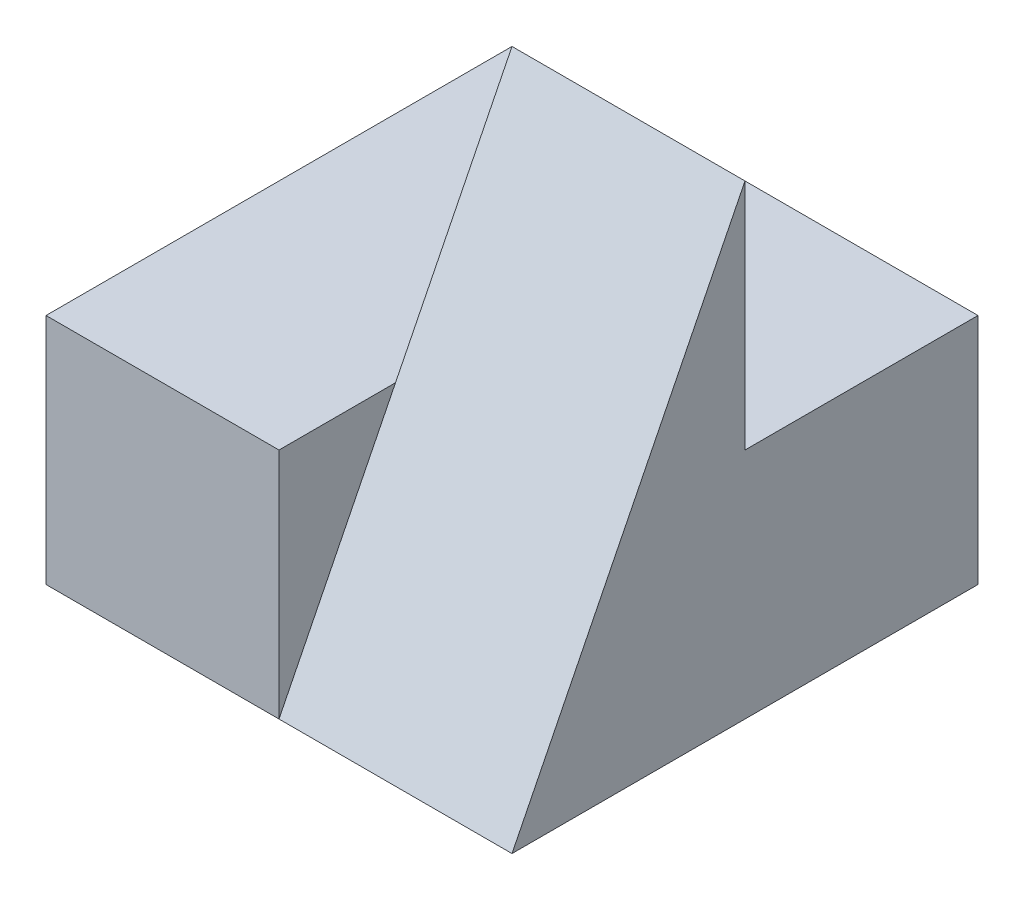
ISO-10303-21;
HEADER;
FILE_DESCRIPTION(('STEP AP214'),'2;1');
FILE_NAME('part.step','',(''),(''),'','','');
FILE_SCHEMA(('AUTOMOTIVE_DESIGN { 1 0 10303 214 1 1 1 1 }'));
ENDSEC;
DATA;
#1=APPLICATION_CONTEXT('core data for automotive mechanical design processes');
#2=APPLICATION_PROTOCOL_DEFINITION('international standard','automotive_design',2000,#1);
#3=PRODUCT_CONTEXT('',#1,'mechanical');
#4=PRODUCT('Part','Part','',(#3));
#5=PRODUCT_RELATED_PRODUCT_CATEGORY('part','',(#4));
#6=PRODUCT_DEFINITION_FORMATION('','',#4);
#7=PRODUCT_DEFINITION_CONTEXT('part definition',#1,'design');
#8=PRODUCT_DEFINITION('design','',#6,#7);
#9=PRODUCT_DEFINITION_SHAPE('','',#8);
#10=(LENGTH_UNIT() NAMED_UNIT(*) SI_UNIT(.MILLI.,.METRE.));
#11=(NAMED_UNIT(*) PLANE_ANGLE_UNIT() SI_UNIT($,.RADIAN.));
#12=(NAMED_UNIT(*) SI_UNIT($,.STERADIAN.) SOLID_ANGLE_UNIT());
#13=UNCERTAINTY_MEASURE_WITH_UNIT(LENGTH_MEASURE(1.E-05),#10,'distance_accuracy_value','');
#14=(GEOMETRIC_REPRESENTATION_CONTEXT(3) GLOBAL_UNCERTAINTY_ASSIGNED_CONTEXT((#13)) GLOBAL_UNIT_ASSIGNED_CONTEXT((#10,
#11,#12)) REPRESENTATION_CONTEXT('',''));
#15=CARTESIAN_POINT('',(0.,0.,0.));
#16=DIRECTION('',(0.,0.,1.));
#17=DIRECTION('',(1.,0.,0.));
#18=AXIS2_PLACEMENT_3D('',#15,#16,#17);
#19=CARTESIAN_POINT('',(0.,4.,0.));
#20=DIRECTION('',(0.,0.,-1.));
#21=DIRECTION('',(-1.,0.,0.));
#22=AXIS2_PLACEMENT_3D('',#19,#20,#21);
#23=PLANE('',#22);
#24=DIRECTION('',(0.,-1.,0.));
#25=VECTOR('',#24,1.);
#26=CARTESIAN_POINT('',(2.,0.,0.));
#27=LINE('',#26,#25);
#28=CARTESIAN_POINT('',(2.,2.,0.));
#29=VERTEX_POINT('',#28);
#30=CARTESIAN_POINT('',(2.,0.,0.));
#31=VERTEX_POINT('',#30);
#32=EDGE_CURVE('E91',#29,#31,#27,.T.);
#33=ORIENTED_EDGE('',*,*,#32,.F.);
#34=DIRECTION('',(1.,0.,0.));
#35=VECTOR('',#34,1.);
#36=CARTESIAN_POINT('',(0.,2.,0.));
#37=LINE('',#36,#35);
#38=CARTESIAN_POINT('',(0.,2.,0.));
#39=VERTEX_POINT('',#38);
#40=EDGE_CURVE('E141',#39,#29,#37,.T.);
#41=ORIENTED_EDGE('',*,*,#40,.F.);
#42=DIRECTION('',(0.,-1.,0.));
#43=VECTOR('',#42,1.);
#44=CARTESIAN_POINT('',(0.,4.,0.));
#45=LINE('',#44,#43);
#46=CARTESIAN_POINT('',(0.,0.,0.));
#47=VERTEX_POINT('',#46);
#48=EDGE_CURVE('E11',#39,#47,#45,.T.);
#49=ORIENTED_EDGE('',*,*,#48,.T.);
#50=DIRECTION('',(1.,0.,0.));
#51=VECTOR('',#50,1.);
#52=CARTESIAN_POINT('',(0.,0.,0.));
#53=LINE('',#52,#51);
#54=EDGE_CURVE('E114',#47,#31,#53,.T.);
#55=ORIENTED_EDGE('',*,*,#54,.T.);
#56=EDGE_LOOP('',(#33,#41,#49,#55));
#57=FACE_BOUND('',#56,.T.);
#58=ADVANCED_FACE('F33',(#57),#23,.F.);
#59=CARTESIAN_POINT('',(0.,4.,0.));
#60=DIRECTION('',(1.,0.,0.));
#61=DIRECTION('',(0.,0.,-1.));
#62=AXIS2_PLACEMENT_3D('',#59,#60,#61);
#63=PLANE('',#62);
#64=DIRECTION('',(0.,0.,1.));
#65=VECTOR('',#64,1.);
#66=CARTESIAN_POINT('',(0.,2.,0.));
#67=LINE('',#66,#65);
#68=CARTESIAN_POINT('',(0.,2.,-4.));
#69=VERTEX_POINT('',#68);
#70=EDGE_CURVE('E139',#69,#39,#67,.T.);
#71=ORIENTED_EDGE('',*,*,#70,.F.);
#72=DIRECTION('',(0.,-1.,0.));
#73=VECTOR('',#72,1.);
#74=CARTESIAN_POINT('',(0.,4.,-4.));
#75=LINE('',#74,#73);
#76=CARTESIAN_POINT('',(0.,0.,-4.));
#77=VERTEX_POINT('',#76);
#78=EDGE_CURVE('E56',#69,#77,#75,.T.);
#79=ORIENTED_EDGE('',*,*,#78,.T.);
#80=DIRECTION('',(0.,0.,1.));
#81=VECTOR('',#80,1.);
#82=CARTESIAN_POINT('',(0.,0.,0.));
#83=LINE('',#82,#81);
#84=EDGE_CURVE('E121',#77,#47,#83,.T.);
#85=ORIENTED_EDGE('',*,*,#84,.T.);
#86=ORIENTED_EDGE('',*,*,#48,.F.);
#87=EDGE_LOOP('',(#71,#79,#85,#86));
#88=FACE_BOUND('',#87,.T.);
#89=ADVANCED_FACE('F35',(#88),#63,.F.);
#90=CARTESIAN_POINT('',(0.,4.,-4.));
#91=DIRECTION('',(0.,0.,1.));
#92=DIRECTION('',(1.,0.,0.));
#93=AXIS2_PLACEMENT_3D('',#90,#91,#92);
#94=PLANE('',#93);
#95=DIRECTION('',(-1.,0.,0.));
#96=VECTOR('',#95,1.);
#97=CARTESIAN_POINT('',(0.,2.,-4.));
#98=LINE('',#97,#96);
#99=CARTESIAN_POINT('',(4.,2.,-4.));
#100=VERTEX_POINT('',#99);
#101=EDGE_CURVE('E134',#100,#69,#98,.T.);
#102=ORIENTED_EDGE('',*,*,#101,.F.);
#103=DIRECTION('',(0.,-1.,0.));
#104=VECTOR('',#103,1.);
#105=CARTESIAN_POINT('',(4.,4.,-4.));
#106=LINE('',#105,#104);
#107=CARTESIAN_POINT('',(4.,0.,-4.));
#108=VERTEX_POINT('',#107);
#109=EDGE_CURVE('E41',#100,#108,#106,.T.);
#110=ORIENTED_EDGE('',*,*,#109,.T.);
#111=DIRECTION('',(-1.,0.,0.));
#112=VECTOR('',#111,1.);
#113=CARTESIAN_POINT('',(0.,0.,-4.));
#114=LINE('',#113,#112);
#115=EDGE_CURVE('E123',#108,#77,#114,.T.);
#116=ORIENTED_EDGE('',*,*,#115,.T.);
#117=ORIENTED_EDGE('',*,*,#78,.F.);
#118=EDGE_LOOP('',(#102,#110,#116,#117));
#119=FACE_BOUND('',#118,.T.);
#120=ADVANCED_FACE('F133',(#119),#94,.F.);
#121=CARTESIAN_POINT('',(4.,4.,0.));
#122=DIRECTION('',(-1.,0.,0.));
#123=DIRECTION('',(0.,0.,1.));
#124=AXIS2_PLACEMENT_3D('',#121,#122,#123);
#125=PLANE('',#124);
#126=DIRECTION('',(0.,1.,0.));
#127=VECTOR('',#126,1.);
#128=CARTESIAN_POINT('',(4.,2.,-2.));
#129=LINE('',#128,#127);
#130=CARTESIAN_POINT('',(4.,2.,-2.));
#131=VERTEX_POINT('',#130);
#132=CARTESIAN_POINT('',(4.,4.,-2.));
#133=VERTEX_POINT('',#132);
#134=EDGE_CURVE('E125',#131,#133,#129,.T.);
#135=ORIENTED_EDGE('',*,*,#134,.T.);
#136=DIRECTION('',(0.,0.894427190999916,-0.447213595499958));
#137=VECTOR('',#136,1.);
#138=CARTESIAN_POINT('',(4.,4.,-2.));
#139=LINE('',#138,#137);
#140=CARTESIAN_POINT('',(4.,0.,0.));
#141=VERTEX_POINT('',#140);
#142=EDGE_CURVE('E100',#141,#133,#139,.T.);
#143=ORIENTED_EDGE('',*,*,#142,.F.);
#144=DIRECTION('',(0.,0.,-1.));
#145=VECTOR('',#144,1.);
#146=CARTESIAN_POINT('',(4.,0.,0.));
#147=LINE('',#146,#145);
#148=EDGE_CURVE('E117',#141,#108,#147,.T.);
#149=ORIENTED_EDGE('',*,*,#148,.T.);
#150=ORIENTED_EDGE('',*,*,#109,.F.);
#151=DIRECTION('',(0.,0.,-1.));
#152=VECTOR('',#151,1.);
#153=CARTESIAN_POINT('',(4.,2.,0.));
#154=LINE('',#153,#152);
#155=EDGE_CURVE('E145',#131,#100,#154,.T.);
#156=ORIENTED_EDGE('',*,*,#155,.F.);
#157=EDGE_LOOP('',(#135,#143,#149,#150,#156));
#158=FACE_BOUND('',#157,.T.);
#159=ADVANCED_FACE('F138',(#158),#125,.F.);
#160=CARTESIAN_POINT('',(0.,0.,0.));
#161=DIRECTION('',(0.,-1.,0.));
#162=DIRECTION('',(0.,0.,-1.));
#163=AXIS2_PLACEMENT_3D('',#160,#161,#162);
#164=PLANE('',#163);
#165=ORIENTED_EDGE('',*,*,#84,.F.);
#166=ORIENTED_EDGE('',*,*,#115,.F.);
#167=ORIENTED_EDGE('',*,*,#148,.F.);
#168=DIRECTION('',(1.,0.,0.));
#169=VECTOR('',#168,1.);
#170=CARTESIAN_POINT('',(2.,0.,0.));
#171=LINE('',#170,#169);
#172=EDGE_CURVE('E105',#31,#141,#171,.T.);
#173=ORIENTED_EDGE('',*,*,#172,.F.);
#174=ORIENTED_EDGE('',*,*,#54,.F.);
#175=EDGE_LOOP('',(#165,#166,#167,#173,#174));
#176=FACE_BOUND('',#175,.T.);
#177=ADVANCED_FACE('F113',(#176),#164,.T.);
#178=CARTESIAN_POINT('',(2.,2.,0.));
#179=DIRECTION('',(-1.,0.,0.));
#180=DIRECTION('',(0.,0.,1.));
#181=AXIS2_PLACEMENT_3D('',#178,#179,#180);
#182=PLANE('',#181);
#183=DIRECTION('',(0.,0.894427190999916,-0.447213595499958));
#184=VECTOR('',#183,1.);
#185=CARTESIAN_POINT('',(2.,4.,-2.));
#186=LINE('',#185,#184);
#187=CARTESIAN_POINT('',(2.,2.,-1.));
#188=VERTEX_POINT('',#187);
#189=CARTESIAN_POINT('',(2.,4.,-2.));
#190=VERTEX_POINT('',#189);
#191=EDGE_CURVE('E99',#188,#190,#186,.T.);
#192=ORIENTED_EDGE('',*,*,#191,.T.);
#193=DIRECTION('',(0.,1.,0.));
#194=VECTOR('',#193,1.);
#195=CARTESIAN_POINT('',(2.,2.,-2.));
#196=LINE('',#195,#194);
#197=CARTESIAN_POINT('',(2.,2.,-2.));
#198=VERTEX_POINT('',#197);
#199=EDGE_CURVE('E143',#198,#190,#196,.T.);
#200=ORIENTED_EDGE('',*,*,#199,.F.);
#201=DIRECTION('',(0.,0.,1.));
#202=VECTOR('',#201,1.);
#203=CARTESIAN_POINT('',(2.,2.,0.));
#204=LINE('',#203,#202);
#205=EDGE_CURVE('E161',#198,#188,#204,.T.);
#206=ORIENTED_EDGE('',*,*,#205,.T.);
#207=EDGE_LOOP('',(#192,#200,#206));
#208=FACE_BOUND('',#207,.T.);
#209=ADVANCED_FACE('F160',(#208),#182,.T.);
#210=CARTESIAN_POINT('',(0.,2.,-2.));
#211=DIRECTION('',(0.,0.,1.));
#212=DIRECTION('',(1.,0.,0.));
#213=AXIS2_PLACEMENT_3D('',#210,#211,#212);
#214=PLANE('',#213);
#215=DIRECTION('',(1.,0.,0.));
#216=VECTOR('',#215,1.);
#217=CARTESIAN_POINT('',(0.,4.,-2.));
#218=LINE('',#217,#216);
#219=EDGE_CURVE('E118',#190,#133,#218,.T.);
#220=ORIENTED_EDGE('',*,*,#219,.T.);
#221=ORIENTED_EDGE('',*,*,#134,.F.);
#222=DIRECTION('',(1.,0.,0.));
#223=VECTOR('',#222,1.);
#224=CARTESIAN_POINT('',(0.,2.,-2.));
#225=LINE('',#224,#223);
#226=EDGE_CURVE('E156',#198,#131,#225,.T.);
#227=ORIENTED_EDGE('',*,*,#226,.F.);
#228=ORIENTED_EDGE('',*,*,#199,.T.);
#229=EDGE_LOOP('',(#220,#221,#227,#228));
#230=FACE_BOUND('',#229,.T.);
#231=ADVANCED_FACE('F154',(#230),#214,.F.);
#232=CARTESIAN_POINT('',(0.,2.,0.));
#233=DIRECTION('',(0.,1.,0.));
#234=DIRECTION('',(0.,0.,1.));
#235=AXIS2_PLACEMENT_3D('',#232,#233,#234);
#236=PLANE('',#235);
#237=ORIENTED_EDGE('',*,*,#205,.F.);
#238=ORIENTED_EDGE('',*,*,#226,.T.);
#239=ORIENTED_EDGE('',*,*,#155,.T.);
#240=ORIENTED_EDGE('',*,*,#101,.T.);
#241=ORIENTED_EDGE('',*,*,#70,.T.);
#242=ORIENTED_EDGE('',*,*,#40,.T.);
#243=EDGE_CURVE('E94',#188,#29,#204,.T.);
#244=ORIENTED_EDGE('',*,*,#243,.F.);
#245=EDGE_LOOP('',(#237,#238,#239,#240,#241,#242,#244));
#246=FACE_BOUND('',#245,.T.);
#247=ADVANCED_FACE('F162',(#246),#236,.T.);
#248=CARTESIAN_POINT('',(2.,4.,-2.));
#249=DIRECTION('',(0.,-0.447213595499958,-0.894427190999916));
#250=DIRECTION('',(0.,0.894427190999916,-0.447213595499958));
#251=AXIS2_PLACEMENT_3D('',#248,#249,#250);
#252=PLANE('',#251);
#253=ORIENTED_EDGE('',*,*,#142,.T.);
#254=ORIENTED_EDGE('',*,*,#219,.F.);
#255=ORIENTED_EDGE('',*,*,#191,.F.);
#256=EDGE_CURVE('E48',#31,#188,#186,.T.);
#257=ORIENTED_EDGE('',*,*,#256,.F.);
#258=ORIENTED_EDGE('',*,*,#172,.T.);
#259=EDGE_LOOP('',(#253,#254,#255,#257,#258));
#260=FACE_BOUND('',#259,.T.);
#261=ADVANCED_FACE('F104',(#260),#252,.F.);
#262=CARTESIAN_POINT('',(2.,0.,0.));
#263=DIRECTION('',(1.,0.,0.));
#264=DIRECTION('',(0.,0.,-1.));
#265=AXIS2_PLACEMENT_3D('',#262,#263,#264);
#266=PLANE('',#265);
#267=ORIENTED_EDGE('',*,*,#32,.T.);
#268=ORIENTED_EDGE('',*,*,#256,.T.);
#269=ORIENTED_EDGE('',*,*,#243,.T.);
#270=EDGE_LOOP('',(#267,#268,#269));
#271=FACE_BOUND('',#270,.T.);
#272=ADVANCED_FACE('F92',(#271),#266,.T.);
#273=CLOSED_SHELL('',(#58,#89,#120,#159,#177,#209,#231,#247,#261,#272));
#274=MANIFOLD_SOLID_BREP('B2',#273);
#275=ADVANCED_BREP_SHAPE_REPRESENTATION('',(#18,#274),#14);
#276=SHAPE_DEFINITION_REPRESENTATION(#9,#275);
ENDSEC;
END-ISO-10303-21;
